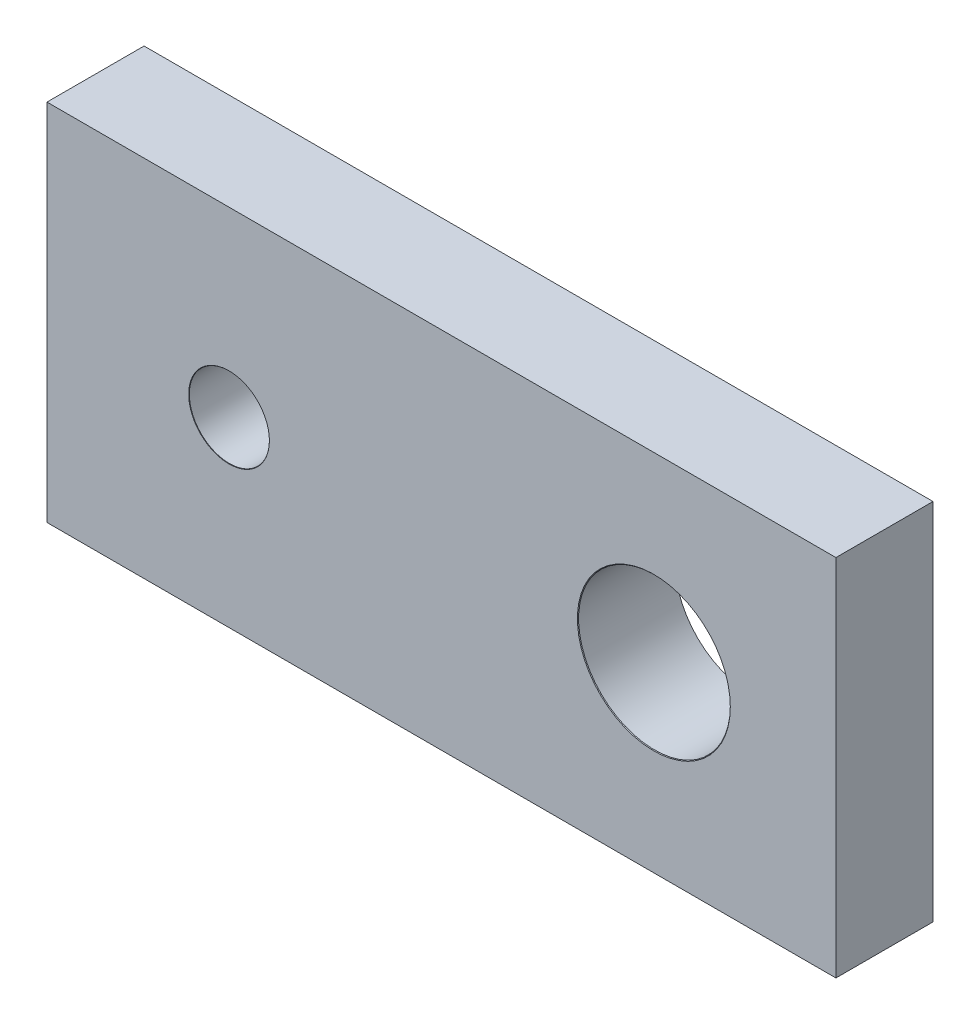
ISO-10303-21;
HEADER;
FILE_DESCRIPTION(('STEP AP214'),'2;1');
FILE_NAME('part.step','',(''),(''),'','','');
FILE_SCHEMA(('AUTOMOTIVE_DESIGN { 1 0 10303 214 1 1 1 1 }'));
ENDSEC;
DATA;
#1=APPLICATION_CONTEXT('core data for automotive mechanical design processes');
#2=APPLICATION_PROTOCOL_DEFINITION('international standard','automotive_design',2000,#1);
#3=PRODUCT_CONTEXT('',#1,'mechanical');
#4=PRODUCT('Part','Part','',(#3));
#5=PRODUCT_RELATED_PRODUCT_CATEGORY('part','',(#4));
#6=PRODUCT_DEFINITION_FORMATION('','',#4);
#7=PRODUCT_DEFINITION_CONTEXT('part definition',#1,'design');
#8=PRODUCT_DEFINITION('design','',#6,#7);
#9=PRODUCT_DEFINITION_SHAPE('','',#8);
#10=(LENGTH_UNIT() NAMED_UNIT(*) SI_UNIT(.MILLI.,.METRE.));
#11=(NAMED_UNIT(*) PLANE_ANGLE_UNIT() SI_UNIT($,.RADIAN.));
#12=(NAMED_UNIT(*) SI_UNIT($,.STERADIAN.) SOLID_ANGLE_UNIT());
#13=UNCERTAINTY_MEASURE_WITH_UNIT(LENGTH_MEASURE(1.E-05),#10,'distance_accuracy_value','');
#14=(GEOMETRIC_REPRESENTATION_CONTEXT(3) GLOBAL_UNCERTAINTY_ASSIGNED_CONTEXT((#13)) GLOBAL_UNIT_ASSIGNED_CONTEXT((#10,
#11,#12)) REPRESENTATION_CONTEXT('',''));
#15=CARTESIAN_POINT('',(0.,0.,0.));
#16=DIRECTION('',(0.,0.,1.));
#17=DIRECTION('',(1.,0.,0.));
#18=AXIS2_PLACEMENT_3D('',#15,#16,#17);
#19=CARTESIAN_POINT('',(32.5,15.,8.));
#20=DIRECTION('',(-1.,0.,0.));
#21=DIRECTION('',(0.,0.,1.));
#22=AXIS2_PLACEMENT_3D('',#19,#20,#21);
#23=PLANE('',#22);
#24=DIRECTION('',(0.,1.,0.));
#25=VECTOR('',#24,1.);
#26=CARTESIAN_POINT('',(32.5,15.,0.));
#27=LINE('',#26,#25);
#28=CARTESIAN_POINT('',(32.5,-15.,0.));
#29=VERTEX_POINT('',#28);
#30=CARTESIAN_POINT('',(32.5,15.,0.));
#31=VERTEX_POINT('',#30);
#32=EDGE_CURVE('E110',#29,#31,#27,.T.);
#33=ORIENTED_EDGE('',*,*,#32,.T.);
#34=DIRECTION('',(0.,0.,-1.));
#35=VECTOR('',#34,1.);
#36=CARTESIAN_POINT('',(32.5,15.,8.));
#37=LINE('',#36,#35);
#38=CARTESIAN_POINT('',(32.5,15.,8.));
#39=VERTEX_POINT('',#38);
#40=EDGE_CURVE('E11',#39,#31,#37,.T.);
#41=ORIENTED_EDGE('',*,*,#40,.F.);
#42=DIRECTION('',(0.,1.,0.));
#43=VECTOR('',#42,1.);
#44=CARTESIAN_POINT('',(32.5,15.,8.));
#45=LINE('',#44,#43);
#46=CARTESIAN_POINT('',(32.5,-15.,8.));
#47=VERTEX_POINT('',#46);
#48=EDGE_CURVE('E93',#47,#39,#45,.T.);
#49=ORIENTED_EDGE('',*,*,#48,.F.);
#50=DIRECTION('',(0.,0.,-1.));
#51=VECTOR('',#50,1.);
#52=CARTESIAN_POINT('',(32.5,-15.,8.));
#53=LINE('',#52,#51);
#54=EDGE_CURVE('E106',#47,#29,#53,.T.);
#55=ORIENTED_EDGE('',*,*,#54,.T.);
#56=EDGE_LOOP('',(#33,#41,#49,#55));
#57=FACE_BOUND('',#56,.T.);
#58=ADVANCED_FACE('F39',(#57),#23,.F.);
#59=CARTESIAN_POINT('',(-32.5,15.,8.));
#60=DIRECTION('',(0.,-1.,0.));
#61=DIRECTION('',(0.,0.,-1.));
#62=AXIS2_PLACEMENT_3D('',#59,#60,#61);
#63=PLANE('',#62);
#64=DIRECTION('',(-1.,0.,0.));
#65=VECTOR('',#64,1.);
#66=CARTESIAN_POINT('',(-32.5,15.,0.));
#67=LINE('',#66,#65);
#68=CARTESIAN_POINT('',(-32.5,15.,0.));
#69=VERTEX_POINT('',#68);
#70=EDGE_CURVE('E98',#31,#69,#67,.T.);
#71=ORIENTED_EDGE('',*,*,#70,.T.);
#72=DIRECTION('',(0.,0.,-1.));
#73=VECTOR('',#72,1.);
#74=CARTESIAN_POINT('',(-32.5,15.,8.));
#75=LINE('',#74,#73);
#76=CARTESIAN_POINT('',(-32.5,15.,8.));
#77=VERTEX_POINT('',#76);
#78=EDGE_CURVE('E49',#77,#69,#75,.T.);
#79=ORIENTED_EDGE('',*,*,#78,.F.);
#80=DIRECTION('',(-1.,0.,0.));
#81=VECTOR('',#80,1.);
#82=CARTESIAN_POINT('',(-32.5,15.,8.));
#83=LINE('',#82,#81);
#84=EDGE_CURVE('E88',#39,#77,#83,.T.);
#85=ORIENTED_EDGE('',*,*,#84,.F.);
#86=ORIENTED_EDGE('',*,*,#40,.T.);
#87=EDGE_LOOP('',(#71,#79,#85,#86));
#88=FACE_BOUND('',#87,.T.);
#89=ADVANCED_FACE('F97',(#88),#63,.F.);
#90=CARTESIAN_POINT('',(-32.5,15.,8.));
#91=DIRECTION('',(1.,0.,0.));
#92=DIRECTION('',(0.,0.,-1.));
#93=AXIS2_PLACEMENT_3D('',#90,#91,#92);
#94=PLANE('',#93);
#95=DIRECTION('',(0.,-1.,0.));
#96=VECTOR('',#95,1.);
#97=CARTESIAN_POINT('',(-32.5,15.,0.));
#98=LINE('',#97,#96);
#99=CARTESIAN_POINT('',(-32.5,-15.,0.));
#100=VERTEX_POINT('',#99);
#101=EDGE_CURVE('E75',#69,#100,#98,.T.);
#102=ORIENTED_EDGE('',*,*,#101,.T.);
#103=DIRECTION('',(0.,0.,-1.));
#104=VECTOR('',#103,1.);
#105=CARTESIAN_POINT('',(-32.5,-15.,8.));
#106=LINE('',#105,#104);
#107=CARTESIAN_POINT('',(-32.5,-15.,8.));
#108=VERTEX_POINT('',#107);
#109=EDGE_CURVE('E100',#108,#100,#106,.T.);
#110=ORIENTED_EDGE('',*,*,#109,.F.);
#111=DIRECTION('',(0.,-1.,0.));
#112=VECTOR('',#111,1.);
#113=CARTESIAN_POINT('',(-32.5,15.,8.));
#114=LINE('',#113,#112);
#115=EDGE_CURVE('E91',#77,#108,#114,.T.);
#116=ORIENTED_EDGE('',*,*,#115,.F.);
#117=ORIENTED_EDGE('',*,*,#78,.T.);
#118=EDGE_LOOP('',(#102,#110,#116,#117));
#119=FACE_BOUND('',#118,.T.);
#120=ADVANCED_FACE('F102',(#119),#94,.F.);
#121=CARTESIAN_POINT('',(-32.5,-15.,8.));
#122=DIRECTION('',(0.,1.,0.));
#123=DIRECTION('',(0.,0.,1.));
#124=AXIS2_PLACEMENT_3D('',#121,#122,#123);
#125=PLANE('',#124);
#126=DIRECTION('',(1.,0.,0.));
#127=VECTOR('',#126,1.);
#128=CARTESIAN_POINT('',(-32.5,-15.,0.));
#129=LINE('',#128,#127);
#130=EDGE_CURVE('E81',#100,#29,#129,.T.);
#131=ORIENTED_EDGE('',*,*,#130,.T.);
#132=ORIENTED_EDGE('',*,*,#54,.F.);
#133=DIRECTION('',(1.,0.,0.));
#134=VECTOR('',#133,1.);
#135=CARTESIAN_POINT('',(-32.5,-15.,8.));
#136=LINE('',#135,#134);
#137=EDGE_CURVE('E58',#108,#47,#136,.T.);
#138=ORIENTED_EDGE('',*,*,#137,.F.);
#139=ORIENTED_EDGE('',*,*,#109,.T.);
#140=EDGE_LOOP('',(#131,#132,#138,#139));
#141=FACE_BOUND('',#140,.T.);
#142=ADVANCED_FACE('F154',(#141),#125,.F.);
#143=CARTESIAN_POINT('',(0.,0.,8.));
#144=DIRECTION('',(0.,0.,1.));
#145=DIRECTION('',(1.,0.,0.));
#146=AXIS2_PLACEMENT_3D('',#143,#144,#145);
#147=PLANE('',#146);
#148=CARTESIAN_POINT('',(17.5,0.,8.00000000000001));
#149=DIRECTION('',(0.,0.,1.));
#150=DIRECTION('',(1.,0.,0.));
#151=AXIS2_PLACEMENT_3D('',#148,#149,#150);
#152=CIRCLE('',#151,6.3);
#153=CARTESIAN_POINT('',(23.8,0.,8.00000000000001));
#154=VERTEX_POINT('',#153);
#155=EDGE_CURVE('E144',#154,#154,#152,.T.);
#156=ORIENTED_EDGE('',*,*,#155,.F.);
#157=EDGE_LOOP('',(#156));
#158=FACE_BOUND('',#157,.T.);
#159=CARTESIAN_POINT('',(-17.5,0.,8.));
#160=DIRECTION('',(0.,0.,1.));
#161=DIRECTION('',(1.,0.,0.));
#162=AXIS2_PLACEMENT_3D('',#159,#160,#161);
#163=CIRCLE('',#162,3.325);
#164=CARTESIAN_POINT('',(-14.175,0.,8.));
#165=VERTEX_POINT('',#164);
#166=EDGE_CURVE('E131',#165,#165,#163,.T.);
#167=ORIENTED_EDGE('',*,*,#166,.F.);
#168=EDGE_LOOP('',(#167));
#169=FACE_BOUND('',#168,.T.);
#170=ORIENTED_EDGE('',*,*,#48,.T.);
#171=ORIENTED_EDGE('',*,*,#84,.T.);
#172=ORIENTED_EDGE('',*,*,#115,.T.);
#173=ORIENTED_EDGE('',*,*,#137,.T.);
#174=EDGE_LOOP('',(#170,#171,#172,#173));
#175=FACE_BOUND('',#174,.T.);
#176=ADVANCED_FACE('F89',(#158,#169,#175),#147,.T.);
#177=CARTESIAN_POINT('',(0.,0.,0.));
#178=DIRECTION('',(0.,0.,1.));
#179=DIRECTION('',(1.,0.,0.));
#180=AXIS2_PLACEMENT_3D('',#177,#178,#179);
#181=PLANE('',#180);
#182=CARTESIAN_POINT('',(17.5,0.,0.));
#183=DIRECTION('',(0.,0.,1.));
#184=DIRECTION('',(1.,0.,0.));
#185=AXIS2_PLACEMENT_3D('',#182,#183,#184);
#186=CIRCLE('',#185,6.25);
#187=CARTESIAN_POINT('',(23.75,0.,0.));
#188=VERTEX_POINT('',#187);
#189=EDGE_CURVE('E42',#188,#188,#186,.T.);
#190=ORIENTED_EDGE('',*,*,#189,.T.);
#191=EDGE_LOOP('',(#190));
#192=FACE_BOUND('',#191,.T.);
#193=CARTESIAN_POINT('',(-17.5,0.,0.));
#194=DIRECTION('',(0.,0.,1.));
#195=DIRECTION('',(1.,0.,0.));
#196=AXIS2_PLACEMENT_3D('',#193,#194,#195);
#197=CIRCLE('',#196,3.3);
#198=CARTESIAN_POINT('',(-14.2,0.,0.));
#199=VERTEX_POINT('',#198);
#200=EDGE_CURVE('E114',#199,#199,#197,.T.);
#201=ORIENTED_EDGE('',*,*,#200,.T.);
#202=EDGE_LOOP('',(#201));
#203=FACE_BOUND('',#202,.T.);
#204=ORIENTED_EDGE('',*,*,#32,.F.);
#205=ORIENTED_EDGE('',*,*,#130,.F.);
#206=ORIENTED_EDGE('',*,*,#101,.F.);
#207=ORIENTED_EDGE('',*,*,#70,.F.);
#208=EDGE_LOOP('',(#204,#205,#206,#207));
#209=FACE_BOUND('',#208,.T.);
#210=ADVANCED_FACE('F153',(#192,#203,#209),#181,.F.);
#211=CARTESIAN_POINT('',(-17.5,0.,8.));
#212=DIRECTION('',(0.,0.,1.));
#213=DIRECTION('',(1.,0.,0.));
#214=AXIS2_PLACEMENT_3D('',#211,#212,#213);
#215=CYLINDRICAL_SURFACE('',#214,3.3);
#216=CARTESIAN_POINT('',(-17.5,0.,7.975));
#217=DIRECTION('',(0.,0.,1.));
#218=DIRECTION('',(1.,0.,0.));
#219=AXIS2_PLACEMENT_3D('',#216,#217,#218);
#220=CIRCLE('',#219,3.3);
#221=CARTESIAN_POINT('',(-14.2,0.,7.975));
#222=VERTEX_POINT('',#221);
#223=EDGE_CURVE('E126',#222,#222,#220,.T.);
#224=ORIENTED_EDGE('',*,*,#223,.T.);
#225=EDGE_LOOP('',(#224));
#226=FACE_BOUND('',#225,.T.);
#227=ORIENTED_EDGE('',*,*,#200,.F.);
#228=EDGE_LOOP('',(#227));
#229=FACE_BOUND('',#228,.T.);
#230=ADVANCED_FACE('F161',(#226,#229),#215,.F.);
#231=CARTESIAN_POINT('',(-17.5,0.,8.));
#232=DIRECTION('',(0.,0.,1.));
#233=DIRECTION('',(1.,0.,0.));
#234=AXIS2_PLACEMENT_3D('',#231,#232,#233);
#235=CONICAL_SURFACE('',#234,3.325,0.785398163397483);
#236=ORIENTED_EDGE('',*,*,#223,.F.);
#237=EDGE_LOOP('',(#236));
#238=FACE_BOUND('',#237,.T.);
#239=ORIENTED_EDGE('',*,*,#166,.T.);
#240=EDGE_LOOP('',(#239));
#241=FACE_BOUND('',#240,.T.);
#242=ADVANCED_FACE('F158',(#238,#241),#235,.F.);
#243=CARTESIAN_POINT('',(17.5,0.,8.));
#244=DIRECTION('',(0.,0.,1.));
#245=DIRECTION('',(1.,0.,0.));
#246=AXIS2_PLACEMENT_3D('',#243,#244,#245);
#247=CYLINDRICAL_SURFACE('',#246,6.25);
#248=CARTESIAN_POINT('',(17.5,0.,7.94999999999999));
#249=DIRECTION('',(0.,0.,1.));
#250=DIRECTION('',(1.,0.,0.));
#251=AXIS2_PLACEMENT_3D('',#248,#249,#250);
#252=CIRCLE('',#251,6.25);
#253=CARTESIAN_POINT('',(23.75,0.,7.94999999999999));
#254=VERTEX_POINT('',#253);
#255=EDGE_CURVE('E140',#254,#254,#252,.T.);
#256=ORIENTED_EDGE('',*,*,#255,.T.);
#257=EDGE_LOOP('',(#256));
#258=FACE_BOUND('',#257,.T.);
#259=ORIENTED_EDGE('',*,*,#189,.F.);
#260=EDGE_LOOP('',(#259));
#261=FACE_BOUND('',#260,.T.);
#262=ADVANCED_FACE('F160',(#258,#261),#247,.F.);
#263=CARTESIAN_POINT('',(17.5,0.,8.00000000000001));
#264=DIRECTION('',(0.,0.,1.));
#265=DIRECTION('',(1.,0.,0.));
#266=AXIS2_PLACEMENT_3D('',#263,#264,#265);
#267=CONICAL_SURFACE('',#266,6.3,0.78539816339731);
#268=ORIENTED_EDGE('',*,*,#255,.F.);
#269=EDGE_LOOP('',(#268));
#270=FACE_BOUND('',#269,.T.);
#271=ORIENTED_EDGE('',*,*,#155,.T.);
#272=EDGE_LOOP('',(#271));
#273=FACE_BOUND('',#272,.T.);
#274=ADVANCED_FACE('F149',(#270,#273),#267,.F.);
#275=CLOSED_SHELL('',(#58,#89,#120,#142,#176,#210,#230,#242,#262,#274));
#276=MANIFOLD_SOLID_BREP('B2',#275);
#277=ADVANCED_BREP_SHAPE_REPRESENTATION('',(#18,#276),#14);
#278=SHAPE_DEFINITION_REPRESENTATION(#9,#277);
ENDSEC;
END-ISO-10303-21;
